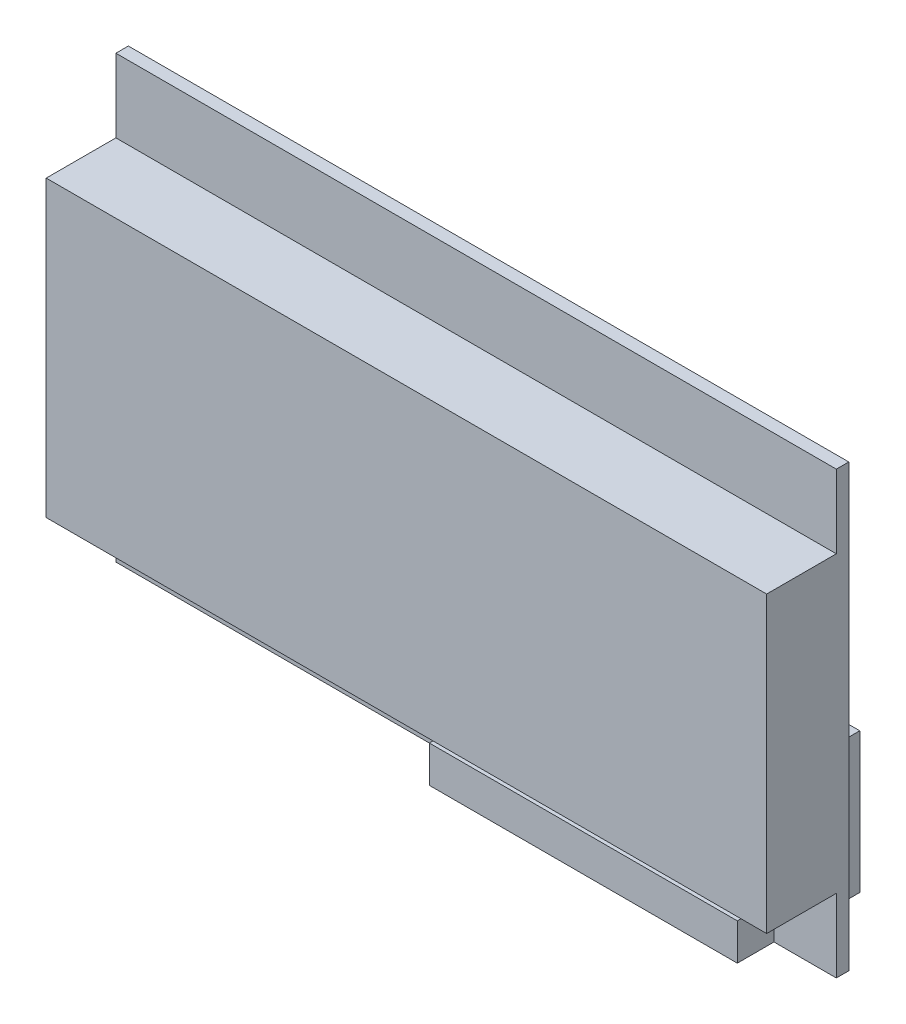
ISO-10303-21;
HEADER;
FILE_DESCRIPTION(('STEP AP214'),'2;1');
FILE_NAME('part.step','',(''),(''),'','','');
FILE_SCHEMA(('AUTOMOTIVE_DESIGN { 1 0 10303 214 1 1 1 1 }'));
ENDSEC;
DATA;
#1=APPLICATION_CONTEXT('core data for automotive mechanical design processes');
#2=APPLICATION_PROTOCOL_DEFINITION('international standard','automotive_design',2000,#1);
#3=PRODUCT_CONTEXT('',#1,'mechanical');
#4=PRODUCT('Part','Part','',(#3));
#5=PRODUCT_RELATED_PRODUCT_CATEGORY('part','',(#4));
#6=PRODUCT_DEFINITION_FORMATION('','',#4);
#7=PRODUCT_DEFINITION_CONTEXT('part definition',#1,'design');
#8=PRODUCT_DEFINITION('design','',#6,#7);
#9=PRODUCT_DEFINITION_SHAPE('','',#8);
#10=(LENGTH_UNIT() NAMED_UNIT(*) SI_UNIT(.MILLI.,.METRE.));
#11=(NAMED_UNIT(*) PLANE_ANGLE_UNIT() SI_UNIT($,.RADIAN.));
#12=(NAMED_UNIT(*) SI_UNIT($,.STERADIAN.) SOLID_ANGLE_UNIT());
#13=UNCERTAINTY_MEASURE_WITH_UNIT(LENGTH_MEASURE(1.E-05),#10,'distance_accuracy_value','');
#14=(GEOMETRIC_REPRESENTATION_CONTEXT(3) GLOBAL_UNCERTAINTY_ASSIGNED_CONTEXT((#13)) GLOBAL_UNIT_ASSIGNED_CONTEXT((#10,
#11,#12)) REPRESENTATION_CONTEXT('',''));
#15=CARTESIAN_POINT('',(0.,0.,0.));
#16=DIRECTION('',(0.,0.,1.));
#17=DIRECTION('',(1.,0.,0.));
#18=AXIS2_PLACEMENT_3D('',#15,#16,#17);
#19=CARTESIAN_POINT('',(0.,0.,1.7));
#20=DIRECTION('',(0.,0.,-1.));
#21=DIRECTION('',(-1.,0.,0.));
#22=AXIS2_PLACEMENT_3D('',#19,#20,#21);
#23=PLANE('',#22);
#24=DIRECTION('',(0.,1.,0.));
#25=VECTOR('',#24,1.);
#26=CARTESIAN_POINT('',(89.75,0.,1.7));
#27=LINE('',#26,#25);
#28=CARTESIAN_POINT('',(89.75,0.,1.7));
#29=VERTEX_POINT('',#28);
#30=CARTESIAN_POINT('',(89.75,5.,1.7));
#31=VERTEX_POINT('',#30);
#32=EDGE_CURVE('E183',#29,#31,#27,.T.);
#33=ORIENTED_EDGE('',*,*,#32,.F.);
#34=DIRECTION('',(1.,0.,0.));
#35=VECTOR('',#34,1.);
#36=CARTESIAN_POINT('',(0.,0.,1.7));
#37=LINE('',#36,#35);
#38=CARTESIAN_POINT('',(98.25,0.,1.7));
#39=VERTEX_POINT('',#38);
#40=EDGE_CURVE('E271',#29,#39,#37,.T.);
#41=ORIENTED_EDGE('',*,*,#40,.T.);
#42=DIRECTION('',(0.,1.,0.));
#43=VECTOR('',#42,1.);
#44=CARTESIAN_POINT('',(98.25,0.,1.7));
#45=LINE('',#44,#43);
#46=CARTESIAN_POINT('',(98.25,10.,1.7));
#47=VERTEX_POINT('',#46);
#48=EDGE_CURVE('E277',#39,#47,#45,.T.);
#49=ORIENTED_EDGE('',*,*,#48,.T.);
#50=DIRECTION('',(1.,0.,0.));
#51=VECTOR('',#50,1.);
#52=CARTESIAN_POINT('',(0.,10.,1.7));
#53=LINE('',#52,#51);
#54=CARTESIAN_POINT('',(0.,10.,1.7));
#55=VERTEX_POINT('',#54);
#56=EDGE_CURVE('E230',#55,#47,#53,.T.);
#57=ORIENTED_EDGE('',*,*,#56,.F.);
#58=DIRECTION('',(0.,-1.,0.));
#59=VECTOR('',#58,1.);
#60=CARTESIAN_POINT('',(0.,0.,1.7));
#61=LINE('',#60,#59);
#62=CARTESIAN_POINT('',(0.,0.,1.7));
#63=VERTEX_POINT('',#62);
#64=EDGE_CURVE('E272',#55,#63,#61,.T.);
#65=ORIENTED_EDGE('',*,*,#64,.T.);
#66=CARTESIAN_POINT('',(47.75,0.,1.7));
#67=VERTEX_POINT('',#66);
#68=EDGE_CURVE('E273',#63,#67,#37,.T.);
#69=ORIENTED_EDGE('',*,*,#68,.T.);
#70=DIRECTION('',(0.,-1.,0.));
#71=VECTOR('',#70,1.);
#72=CARTESIAN_POINT('',(47.75,0.,1.7));
#73=LINE('',#72,#71);
#74=CARTESIAN_POINT('',(47.75,4.99999999999999,1.7));
#75=VERTEX_POINT('',#74);
#76=EDGE_CURVE('E199',#75,#67,#73,.T.);
#77=ORIENTED_EDGE('',*,*,#76,.F.);
#78=DIRECTION('',(-1.,0.,0.));
#79=VECTOR('',#78,1.);
#80=CARTESIAN_POINT('',(89.75,5.,1.7));
#81=LINE('',#80,#79);
#82=EDGE_CURVE('E188',#31,#75,#81,.T.);
#83=ORIENTED_EDGE('',*,*,#82,.F.);
#84=EDGE_LOOP('',(#33,#41,#49,#57,#65,#69,#77,#83));
#85=FACE_BOUND('',#84,.T.);
#86=ADVANCED_FACE('F45',(#85),#23,.F.);
#87=DIRECTION('',(-1.,0.,0.));
#88=VECTOR('',#87,1.);
#89=CARTESIAN_POINT('',(0.,50.1,1.7));
#90=LINE('',#89,#88);
#91=CARTESIAN_POINT('',(98.25,50.1,1.7));
#92=VERTEX_POINT('',#91);
#93=CARTESIAN_POINT('',(0.,50.1,1.7));
#94=VERTEX_POINT('',#93);
#95=EDGE_CURVE('E236',#92,#94,#90,.T.);
#96=ORIENTED_EDGE('',*,*,#95,.F.);
#97=CARTESIAN_POINT('',(98.25,60.1,1.7));
#98=VERTEX_POINT('',#97);
#99=EDGE_CURVE('E276',#92,#98,#45,.T.);
#100=ORIENTED_EDGE('',*,*,#99,.T.);
#101=DIRECTION('',(-1.,0.,0.));
#102=VECTOR('',#101,1.);
#103=CARTESIAN_POINT('',(0.,60.1,1.7));
#104=LINE('',#103,#102);
#105=CARTESIAN_POINT('',(0.,60.1,1.7));
#106=VERTEX_POINT('',#105);
#107=EDGE_CURVE('E280',#98,#106,#104,.T.);
#108=ORIENTED_EDGE('',*,*,#107,.T.);
#109=EDGE_CURVE('E268',#106,#94,#61,.T.);
#110=ORIENTED_EDGE('',*,*,#109,.T.);
#111=EDGE_LOOP('',(#96,#100,#108,#110));
#112=FACE_BOUND('',#111,.T.);
#113=ADVANCED_FACE('F322',(#112),#23,.F.);
#114=CARTESIAN_POINT('',(0.,0.,1.7));
#115=DIRECTION('',(1.,0.,0.));
#116=DIRECTION('',(0.,0.,-1.));
#117=AXIS2_PLACEMENT_3D('',#114,#115,#116);
#118=PLANE('',#117);
#119=DIRECTION('',(0.,-1.,0.));
#120=VECTOR('',#119,1.);
#121=CARTESIAN_POINT('',(0.,0.,0.));
#122=LINE('',#121,#120);
#123=CARTESIAN_POINT('',(0.,60.1,0.));
#124=VERTEX_POINT('',#123);
#125=CARTESIAN_POINT('',(0.,0.,0.));
#126=VERTEX_POINT('',#125);
#127=EDGE_CURVE('E267',#124,#126,#122,.T.);
#128=ORIENTED_EDGE('',*,*,#127,.T.);
#129=DIRECTION('',(0.,0.,-1.));
#130=VECTOR('',#129,1.);
#131=CARTESIAN_POINT('',(0.,0.,1.7));
#132=LINE('',#131,#130);
#133=EDGE_CURVE('E11',#63,#126,#132,.T.);
#134=ORIENTED_EDGE('',*,*,#133,.F.);
#135=ORIENTED_EDGE('',*,*,#64,.F.);
#136=DIRECTION('',(0.,0.,-1.));
#137=VECTOR('',#136,1.);
#138=CARTESIAN_POINT('',(0.,10.,11.2));
#139=LINE('',#138,#137);
#140=CARTESIAN_POINT('',(0.,10.,11.2));
#141=VERTEX_POINT('',#140);
#142=EDGE_CURVE('E263',#141,#55,#139,.T.);
#143=ORIENTED_EDGE('',*,*,#142,.F.);
#144=DIRECTION('',(0.,-1.,0.));
#145=VECTOR('',#144,1.);
#146=CARTESIAN_POINT('',(0.,50.1,11.2));
#147=LINE('',#146,#145);
#148=CARTESIAN_POINT('',(0.,50.1,11.2));
#149=VERTEX_POINT('',#148);
#150=EDGE_CURVE('E231',#149,#141,#147,.T.);
#151=ORIENTED_EDGE('',*,*,#150,.F.);
#152=DIRECTION('',(0.,0.,-1.));
#153=VECTOR('',#152,1.);
#154=CARTESIAN_POINT('',(0.,50.1,11.2));
#155=LINE('',#154,#153);
#156=EDGE_CURVE('E245',#149,#94,#155,.T.);
#157=ORIENTED_EDGE('',*,*,#156,.T.);
#158=ORIENTED_EDGE('',*,*,#109,.F.);
#159=DIRECTION('',(0.,0.,-1.));
#160=VECTOR('',#159,1.);
#161=CARTESIAN_POINT('',(0.,60.1,1.7));
#162=LINE('',#161,#160);
#163=EDGE_CURVE('E283',#106,#124,#162,.T.);
#164=ORIENTED_EDGE('',*,*,#163,.T.);
#165=EDGE_LOOP('',(#128,#134,#135,#143,#151,#157,#158,#164));
#166=FACE_BOUND('',#165,.T.);
#167=ADVANCED_FACE('F47',(#166),#118,.F.);
#168=CARTESIAN_POINT('',(0.,0.,1.7));
#169=DIRECTION('',(0.,1.,0.));
#170=DIRECTION('',(0.,0.,1.));
#171=AXIS2_PLACEMENT_3D('',#168,#169,#170);
#172=PLANE('',#171);
#173=DIRECTION('',(1.,0.,0.));
#174=VECTOR('',#173,1.);
#175=CARTESIAN_POINT('',(0.,0.,0.));
#176=LINE('',#175,#174);
#177=CARTESIAN_POINT('',(47.75,0.,0.));
#178=VERTEX_POINT('',#177);
#179=EDGE_CURVE('E287',#126,#178,#176,.T.);
#180=ORIENTED_EDGE('',*,*,#179,.T.);
#181=DIRECTION('',(0.,0.,1.));
#182=VECTOR('',#181,1.);
#183=CARTESIAN_POINT('',(47.75,0.,-10.));
#184=LINE('',#183,#182);
#185=CARTESIAN_POINT('',(47.75,0.,-10.));
#186=VERTEX_POINT('',#185);
#187=EDGE_CURVE('E164',#186,#178,#184,.T.);
#188=ORIENTED_EDGE('',*,*,#187,.F.);
#189=DIRECTION('',(-1.,0.,0.));
#190=VECTOR('',#189,1.);
#191=CARTESIAN_POINT('',(89.75,0.,-10.));
#192=LINE('',#191,#190);
#193=CARTESIAN_POINT('',(89.75,0.,-10.));
#194=VERTEX_POINT('',#193);
#195=EDGE_CURVE('E157',#194,#186,#192,.T.);
#196=ORIENTED_EDGE('',*,*,#195,.F.);
#197=DIRECTION('',(0.,0.,1.));
#198=VECTOR('',#197,1.);
#199=CARTESIAN_POINT('',(89.75,0.,-10.));
#200=LINE('',#199,#198);
#201=CARTESIAN_POINT('',(89.75,0.,0.));
#202=VERTEX_POINT('',#201);
#203=EDGE_CURVE('E162',#194,#202,#200,.T.);
#204=ORIENTED_EDGE('',*,*,#203,.T.);
#205=CARTESIAN_POINT('',(98.25,0.,0.));
#206=VERTEX_POINT('',#205);
#207=EDGE_CURVE('E66',#202,#206,#176,.T.);
#208=ORIENTED_EDGE('',*,*,#207,.T.);
#209=DIRECTION('',(0.,0.,-1.));
#210=VECTOR('',#209,1.);
#211=CARTESIAN_POINT('',(98.25,0.,1.7));
#212=LINE('',#211,#210);
#213=EDGE_CURVE('E54',#39,#206,#212,.T.);
#214=ORIENTED_EDGE('',*,*,#213,.F.);
#215=ORIENTED_EDGE('',*,*,#40,.F.);
#216=DIRECTION('',(0.,0.,-1.));
#217=VECTOR('',#216,1.);
#218=CARTESIAN_POINT('',(89.75,0.,6.7));
#219=LINE('',#218,#217);
#220=CARTESIAN_POINT('',(89.75,0.,6.7));
#221=VERTEX_POINT('',#220);
#222=EDGE_CURVE('E207',#221,#29,#219,.T.);
#223=ORIENTED_EDGE('',*,*,#222,.F.);
#224=DIRECTION('',(1.,0.,0.));
#225=VECTOR('',#224,1.);
#226=CARTESIAN_POINT('',(89.75,0.,6.7));
#227=LINE('',#226,#225);
#228=CARTESIAN_POINT('',(47.75,0.,6.7));
#229=VERTEX_POINT('',#228);
#230=EDGE_CURVE('E205',#229,#221,#227,.T.);
#231=ORIENTED_EDGE('',*,*,#230,.F.);
#232=DIRECTION('',(0.,0.,-1.));
#233=VECTOR('',#232,1.);
#234=CARTESIAN_POINT('',(47.75,0.,6.7));
#235=LINE('',#234,#233);
#236=EDGE_CURVE('E218',#229,#67,#235,.T.);
#237=ORIENTED_EDGE('',*,*,#236,.T.);
#238=ORIENTED_EDGE('',*,*,#68,.F.);
#239=ORIENTED_EDGE('',*,*,#133,.T.);
#240=EDGE_LOOP('',(#180,#188,#196,#204,#208,#214,#215,#223,#231,#237,#238,#239));
#241=FACE_BOUND('',#240,.T.);
#242=ADVANCED_FACE('F160',(#241),#172,.F.);
#243=CARTESIAN_POINT('',(98.25,0.,1.7));
#244=DIRECTION('',(-1.,0.,0.));
#245=DIRECTION('',(0.,0.,1.));
#246=AXIS2_PLACEMENT_3D('',#243,#244,#245);
#247=PLANE('',#246);
#248=DIRECTION('',(0.,1.,0.));
#249=VECTOR('',#248,1.);
#250=CARTESIAN_POINT('',(98.25,0.,0.));
#251=LINE('',#250,#249);
#252=CARTESIAN_POINT('',(98.25,60.1,0.));
#253=VERTEX_POINT('',#252);
#254=EDGE_CURVE('E290',#206,#253,#251,.T.);
#255=ORIENTED_EDGE('',*,*,#254,.T.);
#256=DIRECTION('',(0.,0.,-1.));
#257=VECTOR('',#256,1.);
#258=CARTESIAN_POINT('',(98.25,60.1,1.7));
#259=LINE('',#258,#257);
#260=EDGE_CURVE('E299',#98,#253,#259,.T.);
#261=ORIENTED_EDGE('',*,*,#260,.F.);
#262=ORIENTED_EDGE('',*,*,#99,.F.);
#263=DIRECTION('',(0.,0.,-1.));
#264=VECTOR('',#263,1.);
#265=CARTESIAN_POINT('',(98.25,50.1,11.2));
#266=LINE('',#265,#264);
#267=CARTESIAN_POINT('',(98.25,50.1,11.2));
#268=VERTEX_POINT('',#267);
#269=EDGE_CURVE('E255',#268,#92,#266,.T.);
#270=ORIENTED_EDGE('',*,*,#269,.F.);
#271=DIRECTION('',(0.,1.,0.));
#272=VECTOR('',#271,1.);
#273=CARTESIAN_POINT('',(98.25,50.1,11.2));
#274=LINE('',#273,#272);
#275=CARTESIAN_POINT('',(98.25,10.,11.2));
#276=VERTEX_POINT('',#275);
#277=EDGE_CURVE('E239',#276,#268,#274,.T.);
#278=ORIENTED_EDGE('',*,*,#277,.F.);
#279=DIRECTION('',(0.,0.,-1.));
#280=VECTOR('',#279,1.);
#281=CARTESIAN_POINT('',(98.25,10.,11.2));
#282=LINE('',#281,#280);
#283=EDGE_CURVE('E259',#276,#47,#282,.T.);
#284=ORIENTED_EDGE('',*,*,#283,.T.);
#285=ORIENTED_EDGE('',*,*,#48,.F.);
#286=ORIENTED_EDGE('',*,*,#213,.T.);
#287=EDGE_LOOP('',(#255,#261,#262,#270,#278,#284,#285,#286));
#288=FACE_BOUND('',#287,.T.);
#289=ADVANCED_FACE('F307',(#288),#247,.F.);
#290=CARTESIAN_POINT('',(0.,60.1,1.7));
#291=DIRECTION('',(0.,-1.,0.));
#292=DIRECTION('',(0.,0.,-1.));
#293=AXIS2_PLACEMENT_3D('',#290,#291,#292);
#294=PLANE('',#293);
#295=DIRECTION('',(-1.,0.,0.));
#296=VECTOR('',#295,1.);
#297=CARTESIAN_POINT('',(0.,60.1,0.));
#298=LINE('',#297,#296);
#299=EDGE_CURVE('E293',#253,#124,#298,.T.);
#300=ORIENTED_EDGE('',*,*,#299,.T.);
#301=ORIENTED_EDGE('',*,*,#163,.F.);
#302=ORIENTED_EDGE('',*,*,#107,.F.);
#303=ORIENTED_EDGE('',*,*,#260,.T.);
#304=EDGE_LOOP('',(#300,#301,#302,#303));
#305=FACE_BOUND('',#304,.T.);
#306=ADVANCED_FACE('F314',(#305),#294,.F.);
#307=CARTESIAN_POINT('',(0.,0.,0.));
#308=DIRECTION('',(0.,0.,-1.));
#309=DIRECTION('',(-1.,0.,0.));
#310=AXIS2_PLACEMENT_3D('',#307,#308,#309);
#311=PLANE('',#310);
#312=DIRECTION('',(0.,-1.,0.));
#313=VECTOR('',#312,1.);
#314=CARTESIAN_POINT('',(89.75,0.,0.));
#315=LINE('',#314,#313);
#316=CARTESIAN_POINT('',(89.75,19.1,0.));
#317=VERTEX_POINT('',#316);
#318=EDGE_CURVE('E61',#317,#202,#315,.T.);
#319=ORIENTED_EDGE('',*,*,#318,.F.);
#320=DIRECTION('',(1.,0.,0.));
#321=VECTOR('',#320,1.);
#322=CARTESIAN_POINT('',(89.75,19.1,0.));
#323=LINE('',#322,#321);
#324=CARTESIAN_POINT('',(47.75,19.1,0.));
#325=VERTEX_POINT('',#324);
#326=EDGE_CURVE('E179',#325,#317,#323,.T.);
#327=ORIENTED_EDGE('',*,*,#326,.F.);
#328=DIRECTION('',(0.,1.,0.));
#329=VECTOR('',#328,1.);
#330=CARTESIAN_POINT('',(47.75,0.,0.));
#331=LINE('',#330,#329);
#332=EDGE_CURVE('E504',#178,#325,#331,.T.);
#333=ORIENTED_EDGE('',*,*,#332,.F.);
#334=ORIENTED_EDGE('',*,*,#179,.F.);
#335=ORIENTED_EDGE('',*,*,#127,.F.);
#336=ORIENTED_EDGE('',*,*,#299,.F.);
#337=ORIENTED_EDGE('',*,*,#254,.F.);
#338=ORIENTED_EDGE('',*,*,#207,.F.);
#339=EDGE_LOOP('',(#319,#327,#333,#334,#335,#336,#337,#338));
#340=FACE_BOUND('',#339,.T.);
#341=ADVANCED_FACE('F310',(#340),#311,.T.);
#342=CARTESIAN_POINT('',(0.,10.,11.2));
#343=DIRECTION('',(0.,1.,0.));
#344=DIRECTION('',(-1.,0.,0.));
#345=AXIS2_PLACEMENT_3D('',#342,#343,#344);
#346=PLANE('',#345);
#347=ORIENTED_EDGE('',*,*,#56,.T.);
#348=ORIENTED_EDGE('',*,*,#283,.F.);
#349=DIRECTION('',(1.,0.,0.));
#350=VECTOR('',#349,1.);
#351=CARTESIAN_POINT('',(0.,10.,11.2));
#352=LINE('',#351,#350);
#353=EDGE_CURVE('E235',#141,#276,#352,.T.);
#354=ORIENTED_EDGE('',*,*,#353,.F.);
#355=ORIENTED_EDGE('',*,*,#142,.T.);
#356=EDGE_LOOP('',(#347,#348,#354,#355));
#357=FACE_BOUND('',#356,.T.);
#358=ADVANCED_FACE('F369',(#357),#346,.F.);
#359=CARTESIAN_POINT('',(0.,50.1,11.2));
#360=DIRECTION('',(0.,-1.,0.));
#361=DIRECTION('',(0.,0.,-1.));
#362=AXIS2_PLACEMENT_3D('',#359,#360,#361);
#363=PLANE('',#362);
#364=ORIENTED_EDGE('',*,*,#95,.T.);
#365=ORIENTED_EDGE('',*,*,#156,.F.);
#366=DIRECTION('',(-1.,0.,0.));
#367=VECTOR('',#366,1.);
#368=CARTESIAN_POINT('',(0.,50.1,11.2));
#369=LINE('',#368,#367);
#370=EDGE_CURVE('E242',#268,#149,#369,.T.);
#371=ORIENTED_EDGE('',*,*,#370,.F.);
#372=ORIENTED_EDGE('',*,*,#269,.T.);
#373=EDGE_LOOP('',(#364,#365,#371,#372));
#374=FACE_BOUND('',#373,.T.);
#375=ADVANCED_FACE('F325',(#374),#363,.F.);
#376=CARTESIAN_POINT('',(0.,0.,11.2));
#377=DIRECTION('',(0.,0.,1.));
#378=DIRECTION('',(1.,0.,0.));
#379=AXIS2_PLACEMENT_3D('',#376,#377,#378);
#380=PLANE('',#379);
#381=ORIENTED_EDGE('',*,*,#150,.T.);
#382=ORIENTED_EDGE('',*,*,#353,.T.);
#383=ORIENTED_EDGE('',*,*,#277,.T.);
#384=ORIENTED_EDGE('',*,*,#370,.T.);
#385=EDGE_LOOP('',(#381,#382,#383,#384));
#386=FACE_BOUND('',#385,.T.);
#387=ADVANCED_FACE('F417',(#386),#380,.T.);
#388=CARTESIAN_POINT('',(89.75,0.,6.7));
#389=DIRECTION('',(-1.,0.,0.));
#390=DIRECTION('',(0.,0.,1.));
#391=AXIS2_PLACEMENT_3D('',#388,#389,#390);
#392=PLANE('',#391);
#393=ORIENTED_EDGE('',*,*,#32,.T.);
#394=DIRECTION('',(0.,0.,-1.));
#395=VECTOR('',#394,1.);
#396=CARTESIAN_POINT('',(89.75,5.,6.7));
#397=LINE('',#396,#395);
#398=CARTESIAN_POINT('',(89.75,5.,6.7));
#399=VERTEX_POINT('',#398);
#400=EDGE_CURVE('E226',#399,#31,#397,.T.);
#401=ORIENTED_EDGE('',*,*,#400,.F.);
#402=DIRECTION('',(0.,1.,0.));
#403=VECTOR('',#402,1.);
#404=CARTESIAN_POINT('',(89.75,0.,6.7));
#405=LINE('',#404,#403);
#406=EDGE_CURVE('E194',#221,#399,#405,.T.);
#407=ORIENTED_EDGE('',*,*,#406,.F.);
#408=ORIENTED_EDGE('',*,*,#222,.T.);
#409=EDGE_LOOP('',(#393,#401,#407,#408));
#410=FACE_BOUND('',#409,.T.);
#411=ADVANCED_FACE('F350',(#410),#392,.F.);
#412=CARTESIAN_POINT('',(89.75,5.,6.7));
#413=DIRECTION('',(0.,-1.,0.));
#414=DIRECTION('',(1.,0.,0.));
#415=AXIS2_PLACEMENT_3D('',#412,#413,#414);
#416=PLANE('',#415);
#417=ORIENTED_EDGE('',*,*,#82,.T.);
#418=DIRECTION('',(0.,0.,-1.));
#419=VECTOR('',#418,1.);
#420=CARTESIAN_POINT('',(47.75,4.99999999999999,6.7));
#421=LINE('',#420,#419);
#422=CARTESIAN_POINT('',(47.75,4.99999999999999,6.7));
#423=VERTEX_POINT('',#422);
#424=EDGE_CURVE('E222',#423,#75,#421,.T.);
#425=ORIENTED_EDGE('',*,*,#424,.F.);
#426=DIRECTION('',(-1.,0.,0.));
#427=VECTOR('',#426,1.);
#428=CARTESIAN_POINT('',(89.75,5.,6.7));
#429=LINE('',#428,#427);
#430=EDGE_CURVE('E198',#399,#423,#429,.T.);
#431=ORIENTED_EDGE('',*,*,#430,.F.);
#432=ORIENTED_EDGE('',*,*,#400,.T.);
#433=EDGE_LOOP('',(#417,#425,#431,#432));
#434=FACE_BOUND('',#433,.T.);
#435=ADVANCED_FACE('F346',(#434),#416,.F.);
#436=CARTESIAN_POINT('',(47.75,0.,6.7));
#437=DIRECTION('',(1.,0.,0.));
#438=DIRECTION('',(0.,0.,-1.));
#439=AXIS2_PLACEMENT_3D('',#436,#437,#438);
#440=PLANE('',#439);
#441=ORIENTED_EDGE('',*,*,#76,.T.);
#442=ORIENTED_EDGE('',*,*,#236,.F.);
#443=DIRECTION('',(0.,-1.,0.));
#444=VECTOR('',#443,1.);
#445=CARTESIAN_POINT('',(47.75,0.,6.7));
#446=LINE('',#445,#444);
#447=EDGE_CURVE('E202',#423,#229,#446,.T.);
#448=ORIENTED_EDGE('',*,*,#447,.F.);
#449=ORIENTED_EDGE('',*,*,#424,.T.);
#450=EDGE_LOOP('',(#441,#442,#448,#449));
#451=FACE_BOUND('',#450,.T.);
#452=ADVANCED_FACE('F343',(#451),#440,.F.);
#453=CARTESIAN_POINT('',(0.,0.,6.7));
#454=DIRECTION('',(0.,0.,1.));
#455=DIRECTION('',(1.,0.,0.));
#456=AXIS2_PLACEMENT_3D('',#453,#454,#455);
#457=PLANE('',#456);
#458=ORIENTED_EDGE('',*,*,#406,.T.);
#459=ORIENTED_EDGE('',*,*,#430,.T.);
#460=ORIENTED_EDGE('',*,*,#447,.T.);
#461=ORIENTED_EDGE('',*,*,#230,.T.);
#462=EDGE_LOOP('',(#458,#459,#460,#461));
#463=FACE_BOUND('',#462,.T.);
#464=ADVANCED_FACE('F352',(#463),#457,.T.);
#465=CARTESIAN_POINT('',(89.75,0.,-10.));
#466=DIRECTION('',(-1.,0.,0.));
#467=DIRECTION('',(0.,0.,1.));
#468=AXIS2_PLACEMENT_3D('',#465,#466,#467);
#469=PLANE('',#468);
#470=ORIENTED_EDGE('',*,*,#318,.T.);
#471=ORIENTED_EDGE('',*,*,#203,.F.);
#472=DIRECTION('',(0.,-1.,0.));
#473=VECTOR('',#472,1.);
#474=CARTESIAN_POINT('',(89.75,0.,-10.));
#475=LINE('',#474,#473);
#476=CARTESIAN_POINT('',(89.75,19.1,-10.));
#477=VERTEX_POINT('',#476);
#478=EDGE_CURVE('E169',#477,#194,#475,.T.);
#479=ORIENTED_EDGE('',*,*,#478,.F.);
#480=DIRECTION('',(0.,0.,1.));
#481=VECTOR('',#480,1.);
#482=CARTESIAN_POINT('',(89.75,19.1,-10.));
#483=LINE('',#482,#481);
#484=EDGE_CURVE('E500',#477,#317,#483,.T.);
#485=ORIENTED_EDGE('',*,*,#484,.T.);
#486=EDGE_LOOP('',(#470,#471,#479,#485));
#487=FACE_BOUND('',#486,.T.);
#488=ADVANCED_FACE('F181',(#487),#469,.F.);
#489=CARTESIAN_POINT('',(47.75,0.,-10.));
#490=DIRECTION('',(1.,0.,0.));
#491=DIRECTION('',(0.,0.,-1.));
#492=AXIS2_PLACEMENT_3D('',#489,#490,#491);
#493=PLANE('',#492);
#494=ORIENTED_EDGE('',*,*,#332,.T.);
#495=DIRECTION('',(0.,0.,1.));
#496=VECTOR('',#495,1.);
#497=CARTESIAN_POINT('',(47.75,19.1,-10.));
#498=LINE('',#497,#496);
#499=CARTESIAN_POINT('',(47.75,19.1,-10.));
#500=VERTEX_POINT('',#499);
#501=EDGE_CURVE('E190',#500,#325,#498,.T.);
#502=ORIENTED_EDGE('',*,*,#501,.F.);
#503=DIRECTION('',(0.,1.,0.));
#504=VECTOR('',#503,1.);
#505=CARTESIAN_POINT('',(47.75,0.,-10.));
#506=LINE('',#505,#504);
#507=EDGE_CURVE('E168',#186,#500,#506,.T.);
#508=ORIENTED_EDGE('',*,*,#507,.F.);
#509=ORIENTED_EDGE('',*,*,#187,.T.);
#510=EDGE_LOOP('',(#494,#502,#508,#509));
#511=FACE_BOUND('',#510,.T.);
#512=ADVANCED_FACE('F359',(#511),#493,.F.);
#513=CARTESIAN_POINT('',(89.75,19.1,-10.));
#514=DIRECTION('',(0.,-1.,0.));
#515=DIRECTION('',(0.,0.,-1.));
#516=AXIS2_PLACEMENT_3D('',#513,#514,#515);
#517=PLANE('',#516);
#518=ORIENTED_EDGE('',*,*,#326,.T.);
#519=ORIENTED_EDGE('',*,*,#484,.F.);
#520=DIRECTION('',(1.,0.,0.));
#521=VECTOR('',#520,1.);
#522=CARTESIAN_POINT('',(89.75,19.1,-10.));
#523=LINE('',#522,#521);
#524=EDGE_CURVE('E174',#500,#477,#523,.T.);
#525=ORIENTED_EDGE('',*,*,#524,.F.);
#526=ORIENTED_EDGE('',*,*,#501,.T.);
#527=EDGE_LOOP('',(#518,#519,#525,#526));
#528=FACE_BOUND('',#527,.T.);
#529=ADVANCED_FACE('F472',(#528),#517,.F.);
#530=CARTESIAN_POINT('',(0.,0.,-10.));
#531=DIRECTION('',(0.,0.,1.));
#532=DIRECTION('',(1.,0.,0.));
#533=AXIS2_PLACEMENT_3D('',#530,#531,#532);
#534=PLANE('',#533);
#535=ORIENTED_EDGE('',*,*,#478,.T.);
#536=ORIENTED_EDGE('',*,*,#195,.T.);
#537=ORIENTED_EDGE('',*,*,#507,.T.);
#538=ORIENTED_EDGE('',*,*,#524,.T.);
#539=EDGE_LOOP('',(#535,#536,#537,#538));
#540=FACE_BOUND('',#539,.T.);
#541=ADVANCED_FACE('F172',(#540),#534,.F.);
#542=CLOSED_SHELL('',(#86,#113,#167,#242,#289,#306,#341,#358,#375,#387,#411,#435,#452,#464,#488,
#512,#529,#541));
#543=MANIFOLD_SOLID_BREP('B2',#542);
#544=ADVANCED_BREP_SHAPE_REPRESENTATION('',(#18,#543),#14);
#545=SHAPE_DEFINITION_REPRESENTATION(#9,#544);
ENDSEC;
END-ISO-10303-21;
